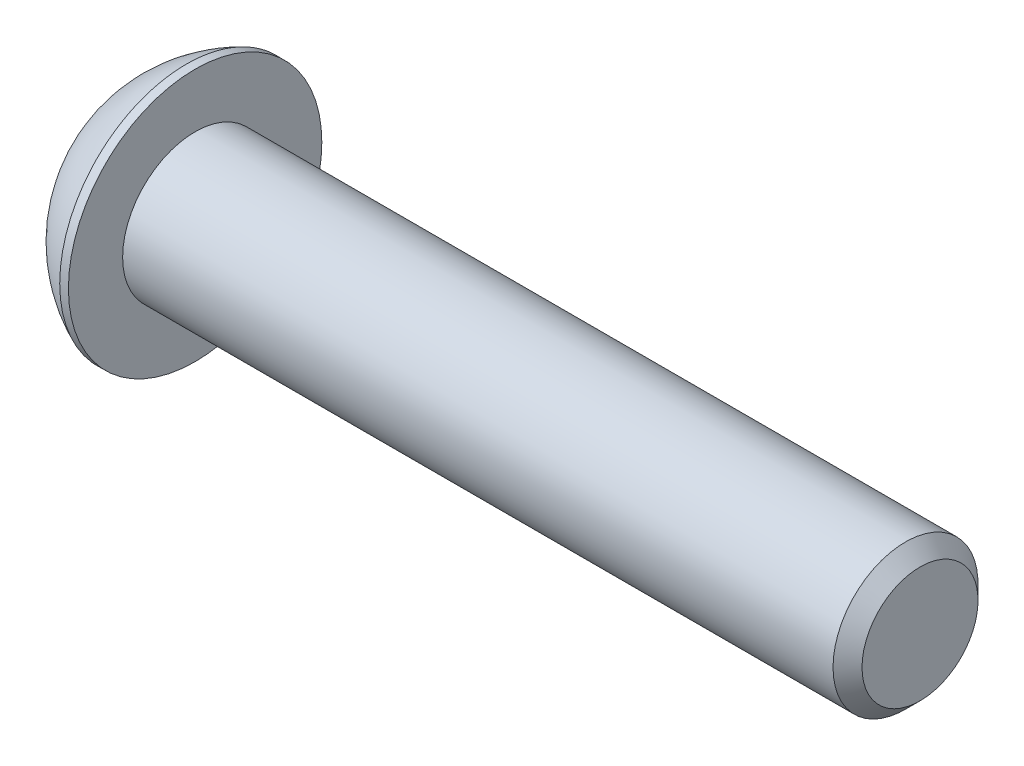
ISO-10303-21;
HEADER;
FILE_DESCRIPTION(('STEP AP214'),'2;1');
FILE_NAME('part.step','',(''),(''),'','','');
FILE_SCHEMA(('AUTOMOTIVE_DESIGN { 1 0 10303 214 1 1 1 1 }'));
ENDSEC;
DATA;
#1=APPLICATION_CONTEXT('core data for automotive mechanical design processes');
#2=APPLICATION_PROTOCOL_DEFINITION('international standard','automotive_design',2000,#1);
#3=PRODUCT_CONTEXT('',#1,'mechanical');
#4=PRODUCT('Part','Part','',(#3));
#5=PRODUCT_RELATED_PRODUCT_CATEGORY('part','',(#4));
#6=PRODUCT_DEFINITION_FORMATION('','',#4);
#7=PRODUCT_DEFINITION_CONTEXT('part definition',#1,'design');
#8=PRODUCT_DEFINITION('design','',#6,#7);
#9=PRODUCT_DEFINITION_SHAPE('','',#8);
#10=(LENGTH_UNIT() NAMED_UNIT(*) SI_UNIT(.MILLI.,.METRE.));
#11=(NAMED_UNIT(*) PLANE_ANGLE_UNIT() SI_UNIT($,.RADIAN.));
#12=(NAMED_UNIT(*) SI_UNIT($,.STERADIAN.) SOLID_ANGLE_UNIT());
#13=UNCERTAINTY_MEASURE_WITH_UNIT(LENGTH_MEASURE(1.E-05),#10,'distance_accuracy_value','');
#14=(GEOMETRIC_REPRESENTATION_CONTEXT(3) GLOBAL_UNCERTAINTY_ASSIGNED_CONTEXT((#13)) GLOBAL_UNIT_ASSIGNED_CONTEXT((#10,
#11,#12)) REPRESENTATION_CONTEXT('',''));
#15=CARTESIAN_POINT('',(0.,0.,0.));
#16=DIRECTION('',(0.,0.,1.));
#17=DIRECTION('',(1.,0.,0.));
#18=AXIS2_PLACEMENT_3D('',#15,#16,#17);
#19=CARTESIAN_POINT('',(1.32080000000034,0.,0.));
#20=DIRECTION('',(-1.,0.,0.));
#21=DIRECTION('',(0.,0.,1.));
#22=AXIS2_PLACEMENT_3D('',#19,#20,#21);
#23=CONICAL_SURFACE('',#22,1.1937999999998,1.04719755119608);
#24=CARTESIAN_POINT('',(2.01004075135902,0.,-4.44089209850063E-13));
#25=VERTEX_POINT('',#24);
#26=VERTEX_LOOP('',#25);
#27=FACE_BOUND('',#26,.T.);
#28=CARTESIAN_POINT('',(1.32080000000009,0.,0.));
#29=DIRECTION('',(-1.,0.,0.));
#30=DIRECTION('',(0.,0.,1.));
#31=AXIS2_PLACEMENT_3D('',#28,#29,#30);
#32=CIRCLE('',#31,1.19380000000024);
#33=CARTESIAN_POINT('',(1.32080000000009,0.,1.19380000000024));
#34=VERTEX_POINT('',#33);
#35=EDGE_CURVE('E20',#34,#34,#32,.T.);
#36=ORIENTED_EDGE('',*,*,#35,.T.);
#37=EDGE_LOOP('',(#36));
#38=FACE_BOUND('',#37,.T.);
#39=ADVANCED_FACE('F17',(#27,#38),#23,.F.);
#40=CARTESIAN_POINT('',(1.3208,-2.29135888084633,0.));
#41=DIRECTION('',(1.,0.,0.));
#42=DIRECTION('',(0.,0.,-1.));
#43=AXIS2_PLACEMENT_3D('',#40,#41,#42);
#44=PLANE('',#43);
#45=DIRECTION('',(0.,1.,0.));
#46=VECTOR('',#45,1.);
#47=CARTESIAN_POINT('',(1.3208,-1.14567944042316,1.984375));
#48=LINE('',#47,#46);
#49=CARTESIAN_POINT('',(1.3208,1.14567944042316,1.984375));
#50=VERTEX_POINT('',#49);
#51=CARTESIAN_POINT('',(1.3208,-1.14567944042316,1.984375));
#52=VERTEX_POINT('',#51);
#53=EDGE_CURVE('E69',#50,#52,#48,.F.);
#54=ORIENTED_EDGE('',*,*,#53,.F.);
#55=DIRECTION('',(0.,0.5,-0.866025403784439));
#56=VECTOR('',#55,1.);
#57=CARTESIAN_POINT('',(1.3208,1.14567944042316,1.984375));
#58=LINE('',#57,#56);
#59=CARTESIAN_POINT('',(1.3208,2.29135888084633,0.));
#60=VERTEX_POINT('',#59);
#61=EDGE_CURVE('E287',#60,#50,#58,.F.);
#62=ORIENTED_EDGE('',*,*,#61,.F.);
#63=DIRECTION('',(0.,-0.5,-0.866025403784439));
#64=VECTOR('',#63,1.);
#65=CARTESIAN_POINT('',(1.3208,2.29135888084633,0.));
#66=LINE('',#65,#64);
#67=CARTESIAN_POINT('',(1.3208,1.14567944042316,-1.984375));
#68=VERTEX_POINT('',#67);
#69=EDGE_CURVE('E291',#68,#60,#66,.F.);
#70=ORIENTED_EDGE('',*,*,#69,.F.);
#71=DIRECTION('',(0.,1.,0.));
#72=VECTOR('',#71,1.);
#73=CARTESIAN_POINT('',(1.3208,1.14567944042316,-1.984375));
#74=LINE('',#73,#72);
#75=CARTESIAN_POINT('',(1.3208,-1.14567944042316,-1.984375));
#76=VERTEX_POINT('',#75);
#77=EDGE_CURVE('E296',#76,#68,#74,.T.);
#78=ORIENTED_EDGE('',*,*,#77,.F.);
#79=DIRECTION('',(0.,-0.500000000000001,0.866025403784438));
#80=VECTOR('',#79,1.);
#81=CARTESIAN_POINT('',(1.3208,-1.14567944042316,-1.984375));
#82=LINE('',#81,#80);
#83=CARTESIAN_POINT('',(1.3208,-2.29135888084633,0.));
#84=VERTEX_POINT('',#83);
#85=EDGE_CURVE('E301',#84,#76,#82,.F.);
#86=ORIENTED_EDGE('',*,*,#85,.F.);
#87=DIRECTION('',(0.,0.500000000000001,0.866025403784438));
#88=VECTOR('',#87,1.);
#89=CARTESIAN_POINT('',(1.3208,-2.29135888084633,0.));
#90=LINE('',#89,#88);
#91=EDGE_CURVE('E82',#52,#84,#90,.F.);
#92=ORIENTED_EDGE('',*,*,#91,.F.);
#93=EDGE_LOOP('',(#54,#62,#70,#78,#86,#92));
#94=FACE_BOUND('',#93,.T.);
#95=ORIENTED_EDGE('',*,*,#35,.F.);
#96=EDGE_LOOP('',(#95));
#97=FACE_BOUND('',#96,.T.);
#98=ADVANCED_FACE('F75',(#94,#97),#44,.F.);
#99=CARTESIAN_POINT('',(1.3208,-1.14567944042316,1.984375));
#100=DIRECTION('',(0.,0.,-1.));
#101=DIRECTION('',(0.,1.,0.));
#102=AXIS2_PLACEMENT_3D('',#99,#100,#101);
#103=PLANE('',#102);
#104=ORIENTED_EDGE('',*,*,#53,.T.);
#105=DIRECTION('',(1.,0.,0.));
#106=VECTOR('',#105,1.);
#107=CARTESIAN_POINT('',(1.3208,-1.14567944042316,1.984375));
#108=LINE('',#107,#106);
#109=CARTESIAN_POINT('',(0.,-1.14567944042316,1.984375));
#110=VERTEX_POINT('',#109);
#111=EDGE_CURVE('E79',#110,#52,#108,.T.);
#112=ORIENTED_EDGE('',*,*,#111,.F.);
#113=DIRECTION('',(0.,1.,0.));
#114=VECTOR('',#113,1.);
#115=CARTESIAN_POINT('',(0.,0.,1.984375));
#116=LINE('',#115,#114);
#117=CARTESIAN_POINT('',(0.,1.14567944042316,1.984375));
#118=VERTEX_POINT('',#117);
#119=EDGE_CURVE('E281',#118,#110,#116,.F.);
#120=ORIENTED_EDGE('',*,*,#119,.F.);
#121=DIRECTION('',(1.,0.,0.));
#122=VECTOR('',#121,1.);
#123=CARTESIAN_POINT('',(1.3208,1.14567944042316,1.984375));
#124=LINE('',#123,#122);
#125=EDGE_CURVE('E284',#50,#118,#124,.F.);
#126=ORIENTED_EDGE('',*,*,#125,.F.);
#127=EDGE_LOOP('',(#104,#112,#120,#126));
#128=FACE_BOUND('',#127,.T.);
#129=ADVANCED_FACE('F128',(#128),#103,.T.);
#130=CARTESIAN_POINT('',(1.3208,-2.29135888084633,0.));
#131=DIRECTION('',(0.,0.866025403784438,-0.500000000000001));
#132=DIRECTION('',(0.,0.500000000000001,0.866025403784438));
#133=AXIS2_PLACEMENT_3D('',#130,#131,#132);
#134=PLANE('',#133);
#135=ORIENTED_EDGE('',*,*,#91,.T.);
#136=DIRECTION('',(1.,0.,0.));
#137=VECTOR('',#136,1.);
#138=CARTESIAN_POINT('',(1.3208,-2.29135888084633,0.));
#139=LINE('',#138,#137);
#140=CARTESIAN_POINT('',(0.,-2.29135888084633,0.));
#141=VERTEX_POINT('',#140);
#142=EDGE_CURVE('E303',#141,#84,#139,.T.);
#143=ORIENTED_EDGE('',*,*,#142,.F.);
#144=DIRECTION('',(0.,-0.500000000000001,-0.866025403784438));
#145=VECTOR('',#144,1.);
#146=CARTESIAN_POINT('',(0.,-1.14567944042316,1.984375));
#147=LINE('',#146,#145);
#148=EDGE_CURVE('E278',#110,#141,#147,.T.);
#149=ORIENTED_EDGE('',*,*,#148,.F.);
#150=ORIENTED_EDGE('',*,*,#111,.T.);
#151=EDGE_LOOP('',(#135,#143,#149,#150));
#152=FACE_BOUND('',#151,.T.);
#153=ADVANCED_FACE('F124',(#152),#134,.T.);
#154=CARTESIAN_POINT('',(1.3208,-1.14567944042316,-1.984375));
#155=DIRECTION('',(0.,0.866025403784438,0.500000000000001));
#156=DIRECTION('',(0.,-0.500000000000001,0.866025403784438));
#157=AXIS2_PLACEMENT_3D('',#154,#155,#156);
#158=PLANE('',#157);
#159=ORIENTED_EDGE('',*,*,#85,.T.);
#160=DIRECTION('',(1.,0.,0.));
#161=VECTOR('',#160,1.);
#162=CARTESIAN_POINT('',(1.3208,-1.14567944042316,-1.984375));
#163=LINE('',#162,#161);
#164=CARTESIAN_POINT('',(0.,-1.14567944042316,-1.984375));
#165=VERTEX_POINT('',#164);
#166=EDGE_CURVE('E298',#165,#76,#163,.T.);
#167=ORIENTED_EDGE('',*,*,#166,.F.);
#168=DIRECTION('',(0.,0.500000000000001,-0.866025403784438));
#169=VECTOR('',#168,1.);
#170=CARTESIAN_POINT('',(0.,-2.29135888084633,0.));
#171=LINE('',#170,#169);
#172=EDGE_CURVE('E275',#141,#165,#171,.T.);
#173=ORIENTED_EDGE('',*,*,#172,.F.);
#174=ORIENTED_EDGE('',*,*,#142,.T.);
#175=EDGE_LOOP('',(#159,#167,#173,#174));
#176=FACE_BOUND('',#175,.T.);
#177=ADVANCED_FACE('F120',(#176),#158,.T.);
#178=CARTESIAN_POINT('',(1.3208,1.14567944042316,-1.984375));
#179=DIRECTION('',(0.,0.,1.));
#180=DIRECTION('',(1.,0.,0.));
#181=AXIS2_PLACEMENT_3D('',#178,#179,#180);
#182=PLANE('',#181);
#183=ORIENTED_EDGE('',*,*,#77,.T.);
#184=DIRECTION('',(1.,0.,0.));
#185=VECTOR('',#184,1.);
#186=CARTESIAN_POINT('',(1.3208,1.14567944042316,-1.984375));
#187=LINE('',#186,#185);
#188=CARTESIAN_POINT('',(0.,1.14567944042316,-1.984375));
#189=VERTEX_POINT('',#188);
#190=EDGE_CURVE('E293',#189,#68,#187,.T.);
#191=ORIENTED_EDGE('',*,*,#190,.F.);
#192=DIRECTION('',(0.,1.,0.));
#193=VECTOR('',#192,1.);
#194=CARTESIAN_POINT('',(0.,0.,-1.984375));
#195=LINE('',#194,#193);
#196=EDGE_CURVE('E272',#165,#189,#195,.T.);
#197=ORIENTED_EDGE('',*,*,#196,.F.);
#198=ORIENTED_EDGE('',*,*,#166,.T.);
#199=EDGE_LOOP('',(#183,#191,#197,#198));
#200=FACE_BOUND('',#199,.T.);
#201=ADVANCED_FACE('F117',(#200),#182,.T.);
#202=CARTESIAN_POINT('',(1.3208,2.29135888084633,0.));
#203=DIRECTION('',(0.,-0.866025403784439,0.5));
#204=DIRECTION('',(0.,-0.5,-0.866025403784439));
#205=AXIS2_PLACEMENT_3D('',#202,#203,#204);
#206=PLANE('',#205);
#207=ORIENTED_EDGE('',*,*,#69,.T.);
#208=DIRECTION('',(1.,0.,0.));
#209=VECTOR('',#208,1.);
#210=CARTESIAN_POINT('',(1.3208,2.29135888084633,0.));
#211=LINE('',#210,#209);
#212=CARTESIAN_POINT('',(0.,2.29135888084633,0.));
#213=VERTEX_POINT('',#212);
#214=EDGE_CURVE('E35',#213,#60,#211,.T.);
#215=ORIENTED_EDGE('',*,*,#214,.F.);
#216=DIRECTION('',(0.,0.5,0.866025403784439));
#217=VECTOR('',#216,1.);
#218=CARTESIAN_POINT('',(0.,1.14567944042316,-1.984375));
#219=LINE('',#218,#217);
#220=EDGE_CURVE('E269',#189,#213,#219,.T.);
#221=ORIENTED_EDGE('',*,*,#220,.F.);
#222=ORIENTED_EDGE('',*,*,#190,.T.);
#223=EDGE_LOOP('',(#207,#215,#221,#222));
#224=FACE_BOUND('',#223,.T.);
#225=ADVANCED_FACE('F113',(#224),#206,.T.);
#226=CARTESIAN_POINT('',(1.3208,1.14567944042316,1.984375));
#227=DIRECTION('',(0.,-0.866025403784439,-0.5));
#228=DIRECTION('',(0.,0.5,-0.866025403784439));
#229=AXIS2_PLACEMENT_3D('',#226,#227,#228);
#230=PLANE('',#229);
#231=ORIENTED_EDGE('',*,*,#61,.T.);
#232=ORIENTED_EDGE('',*,*,#125,.T.);
#233=DIRECTION('',(0.,-0.5,0.866025403784438));
#234=VECTOR('',#233,1.);
#235=CARTESIAN_POINT('',(0.,2.29135888084633,0.));
#236=LINE('',#235,#234);
#237=EDGE_CURVE('E100',#213,#118,#236,.T.);
#238=ORIENTED_EDGE('',*,*,#237,.F.);
#239=ORIENTED_EDGE('',*,*,#214,.T.);
#240=EDGE_LOOP('',(#231,#232,#238,#239));
#241=FACE_BOUND('',#240,.T.);
#242=ADVANCED_FACE('F109',(#241),#230,.T.);
#243=CARTESIAN_POINT('',(0.,0.,0.));
#244=DIRECTION('',(-1.,0.,0.));
#245=DIRECTION('',(0.,0.,1.));
#246=AXIS2_PLACEMENT_3D('',#243,#244,#245);
#247=PLANE('',#246);
#248=ORIENTED_EDGE('',*,*,#220,.T.);
#249=ORIENTED_EDGE('',*,*,#237,.T.);
#250=ORIENTED_EDGE('',*,*,#119,.T.);
#251=ORIENTED_EDGE('',*,*,#148,.T.);
#252=ORIENTED_EDGE('',*,*,#172,.T.);
#253=ORIENTED_EDGE('',*,*,#196,.T.);
#254=EDGE_LOOP('',(#248,#249,#250,#251,#252,#253));
#255=FACE_BOUND('',#254,.T.);
#256=CARTESIAN_POINT('',(0.,2.77495,0.));
#257=CARTESIAN_POINT('',(0.,2.77494953309947,0.0779118937523459));
#258=CARTESIAN_POINT('',(0.,2.77166578388025,0.15583810591977));
#259=CARTESIAN_POINT('',(0.,2.75855213600204,0.311152012455904));
#260=CARTESIAN_POINT('',(0.,2.74872030471467,0.388539541019556));
#261=CARTESIAN_POINT('',(0.,2.72255472645676,0.542341518735717));
#262=CARTESIAN_POINT('',(-2.70414110576258E-13,2.70621065843663,0.618754223567578));
#263=CARTESIAN_POINT('',(2.71501725221868E-13,2.66713326915777,0.769973634286023));
#264=CARTESIAN_POINT('',(1.01274952524446E-12,2.64439476297869,0.844778983646282));
#265=CARTESIAN_POINT('',(1.81909959813207E-12,2.56690195943351,1.06566239301792));
#266=CARTESIAN_POINT('',(4.77081687541822E-13,2.50280672569928,1.20857954243987));
#267=CARTESIAN_POINT('',(-4.76232447128612E-13,2.35149826934097,1.48160874561538));
#268=CARTESIAN_POINT('',(0.,2.26428416790397,1.61172031233499));
#269=CARTESIAN_POINT('',(0.,2.1181093928834,1.79445660654268));
#270=CARTESIAN_POINT('',(0.,2.06678693791626,1.85333128513996));
#271=CARTESIAN_POINT('',(0.,1.95940522984449,1.96650727912792));
#272=CARTESIAN_POINT('',(0.,1.90335059143535,2.02081294920044));
#273=CARTESIAN_POINT('',(0.,1.78683891013963,2.12453280878582));
#274=CARTESIAN_POINT('',(0.,1.72637988450322,2.1739447713554));
#275=CARTESIAN_POINT('',(0.,1.60151968865711,2.26750481692908));
#276=CARTESIAN_POINT('',(0.,1.53711760864537,2.31165167810847));
#277=CARTESIAN_POINT('',(0.,1.33869902291632,2.43567242603944));
#278=CARTESIAN_POINT('',(0.,1.19934704110695,2.507235886628));
#279=CARTESIAN_POINT('',(0.,0.910681609121881,2.62590828672821));
#280=CARTESIAN_POINT('',(0.,0.761368265357398,2.67301748742278));
#281=CARTESIAN_POINT('',(0.,0.456932649466623,2.74151230664007));
#282=CARTESIAN_POINT('',(0.,0.301810346322584,2.76289778778721));
#283=CARTESIAN_POINT('',(0.,-0.00982263870895171,2.77931595661156));
#284=CARTESIAN_POINT('',(0.,-0.166333320596448,2.77434864428877));
#285=CARTESIAN_POINT('',(0.,-0.476280836814452,2.73822217653073));
#286=CARTESIAN_POINT('',(0.,-0.629717687555985,2.70706316096981));
#287=CARTESIAN_POINT('',(0.,-0.929254830044274,2.61937980771149));
#288=CARTESIAN_POINT('',(0.,-1.0753550434132,2.56285519909568));
#289=CARTESIAN_POINT('',(0.,-1.28570692598579,2.46037024128109));
#290=CARTESIAN_POINT('',(0.,-1.35439130022287,2.42323494812896));
#291=CARTESIAN_POINT('',(0.,-1.488391287199,2.34331277270256));
#292=CARTESIAN_POINT('',(0.,-1.55370767631787,2.30052720108831));
#293=CARTESIAN_POINT('',(0.,-1.68047292776594,2.20962421887055));
#294=CARTESIAN_POINT('',(0.,-1.7419235278682,2.16150923122348));
#295=CARTESIAN_POINT('',(0.,-1.86060297067992,2.06024311301283));
#296=CARTESIAN_POINT('',(0.,-1.91782768181715,2.0070871669763));
#297=CARTESIAN_POINT('',(0.,-2.08239462196651,1.8407220856554));
#298=CARTESIAN_POINT('',(0.,-2.18279764272601,1.72049499758422));
#299=CARTESIAN_POINT('',(0.,-2.36195754944063,1.46487629213018));
#300=CARTESIAN_POINT('',(0.,-2.44071525816758,1.32948525142807));
#301=CARTESIAN_POINT('',(0.,-2.54098882695274,1.11796734074395));
#302=CARTESIAN_POINT('',(0.,-2.57146177392727,1.04596540008347));
#303=CARTESIAN_POINT('',(0.,-2.62621251108999,0.899689259475764));
#304=CARTESIAN_POINT('',(0.,-2.65049531495563,0.825416953360952));
#305=CARTESIAN_POINT('',(0.,-2.69267708798766,0.675215808695207));
#306=CARTESIAN_POINT('',(0.,-2.71058613777937,0.599289789313092));
#307=CARTESIAN_POINT('',(0.,-2.73994710360127,0.446213628496932));
#308=CARTESIAN_POINT('',(0.,-2.75140092413871,0.369063855024788));
#309=CARTESIAN_POINT('',(0.,-2.76470470685522,0.24316208817343));
#310=CARTESIAN_POINT('',(0.,-2.76854547596618,0.194611672428577));
#311=CARTESIAN_POINT('',(0.,-2.77366826843264,0.0973760351839812));
#312=CARTESIAN_POINT('',(0.,-2.77495029178814,0.0486908136842395));
#313=CARTESIAN_POINT('',(0.,-2.77494953309947,-0.0779118937523475));
#314=CARTESIAN_POINT('',(0.,-2.77166578388025,-0.155838105919772));
#315=CARTESIAN_POINT('',(0.,-2.75855213600204,-0.311152012455906));
#316=CARTESIAN_POINT('',(0.,-2.74872030471467,-0.388539541019558));
#317=CARTESIAN_POINT('',(0.,-2.72255472645677,-0.542341518735719));
#318=CARTESIAN_POINT('',(-2.70149297926331E-13,-2.70621065843663,-0.61875422356758));
#319=CARTESIAN_POINT('',(2.712366972268E-13,-2.66713326915777,-0.769973634286024));
#320=CARTESIAN_POINT('',(1.0114146773846E-12,-2.64439476297869,-0.844778983646283));
#321=CARTESIAN_POINT('',(1.81656702958366E-12,-2.5669019594335,-1.06566239301792));
#322=CARTESIAN_POINT('',(4.7641829195856E-13,-2.50280672569928,-1.20857954243988));
#323=CARTESIAN_POINT('',(-4.75569026324205E-13,-2.35149826934097,-1.48160874561538));
#324=CARTESIAN_POINT('',(0.,-2.26428416790396,-1.61172031233499));
#325=CARTESIAN_POINT('',(0.,-2.1181093928834,-1.79445660654268));
#326=CARTESIAN_POINT('',(0.,-2.06678693791626,-1.85333128513997));
#327=CARTESIAN_POINT('',(0.,-1.95940522984449,-1.96650727912792));
#328=CARTESIAN_POINT('',(0.,-1.90335059143535,-2.02081294920044));
#329=CARTESIAN_POINT('',(0.,-1.78683891013963,-2.12453280878582));
#330=CARTESIAN_POINT('',(0.,-1.72637988450322,-2.1739447713554));
#331=CARTESIAN_POINT('',(0.,-1.60151968865711,-2.26750481692908));
#332=CARTESIAN_POINT('',(0.,-1.53711760864537,-2.31165167810847));
#333=CARTESIAN_POINT('',(0.,-1.33869902291632,-2.43567242603944));
#334=CARTESIAN_POINT('',(0.,-1.19934704110695,-2.507235886628));
#335=CARTESIAN_POINT('',(0.,-0.91068160912188,-2.62590828672821));
#336=CARTESIAN_POINT('',(0.,-0.761368265357396,-2.67301748742278));
#337=CARTESIAN_POINT('',(0.,-0.456932649466621,-2.74151230664007));
#338=CARTESIAN_POINT('',(0.,-0.301810346322582,-2.76289778778721));
#339=CARTESIAN_POINT('',(0.,0.00982263870895353,-2.77931595661156));
#340=CARTESIAN_POINT('',(0.,0.16633332059645,-2.77434864428876));
#341=CARTESIAN_POINT('',(0.,0.476280836814454,-2.73822217653073));
#342=CARTESIAN_POINT('',(0.,0.629717687555987,-2.70706316096981));
#343=CARTESIAN_POINT('',(0.,0.929254830044276,-2.6193798077115));
#344=CARTESIAN_POINT('',(0.,1.0753550434132,-2.56285519909568));
#345=CARTESIAN_POINT('',(0.,1.28570692598579,-2.46037024128109));
#346=CARTESIAN_POINT('',(0.,1.35439130022287,-2.42323494812896));
#347=CARTESIAN_POINT('',(0.,1.488391287199,-2.34331277270256));
#348=CARTESIAN_POINT('',(0.,1.55370767631787,-2.30052720108831));
#349=CARTESIAN_POINT('',(0.,1.68047292776594,-2.20962421887055));
#350=CARTESIAN_POINT('',(0.,1.7419235278682,-2.16150923122348));
#351=CARTESIAN_POINT('',(0.,1.86060297067992,-2.06024311301282));
#352=CARTESIAN_POINT('',(0.,1.91782768181716,-2.0070871669763));
#353=CARTESIAN_POINT('',(0.,2.08239462196651,-1.8407220856554));
#354=CARTESIAN_POINT('',(0.,2.18279764272601,-1.72049499758422));
#355=CARTESIAN_POINT('',(0.,2.36195754944063,-1.46487629213018));
#356=CARTESIAN_POINT('',(0.,2.44071525816757,-1.32948525142807));
#357=CARTESIAN_POINT('',(0.,2.54098882695273,-1.11796734074395));
#358=CARTESIAN_POINT('',(0.,2.57146177392727,-1.04596540008347));
#359=CARTESIAN_POINT('',(0.,2.62621251108999,-0.899689259475765));
#360=CARTESIAN_POINT('',(0.,2.65049531495563,-0.825416953360953));
#361=CARTESIAN_POINT('',(0.,2.69267708798766,-0.675215808695207));
#362=CARTESIAN_POINT('',(0.,2.71058613777936,-0.599289789313092));
#363=CARTESIAN_POINT('',(0.,2.73994710360127,-0.446213628496932));
#364=CARTESIAN_POINT('',(0.,2.75140092413871,-0.369063855024789));
#365=CARTESIAN_POINT('',(0.,2.76470470685522,-0.243162088173432));
#366=CARTESIAN_POINT('',(0.,2.76854547596618,-0.194611672428578));
#367=CARTESIAN_POINT('',(0.,2.77366826843264,-0.0973760351839823));
#368=CARTESIAN_POINT('',(0.,2.77495029178814,-0.0486908136842408));
#369=CARTESIAN_POINT('',(0.,2.77495,0.));
#370=B_SPLINE_CURVE_WITH_KNOTS('',3,(#256,#257,#258,#259,#260,#261,#262,#263,#264,#265,#266,
#267,#268,#269,#270,#271,#272,#273,#274,#275,#276,#277,#278,#279,#280,#281,#282,#283,#284,#285,
#286,#287,#288,#289,#290,#291,#292,#293,#294,#295,#296,#297,#298,#299,#300,#301,#302,#303,#304,
#305,#306,#307,#308,#309,#310,#311,#312,#313,#314,#315,#316,#317,#318,#319,#320,#321,#322,#323,
#324,#325,#326,#327,#328,#329,#330,#331,#332,#333,#334,#335,#336,#337,#338,#339,#340,#341,#342,
#343,#344,#345,#346,#347,#348,#349,#350,#351,#352,#353,#354,#355,#356,#357,#358,#359,#360,#361,
#362,#363,#364,#365,#366,#367,#368,#369),.UNSPECIFIED.,.T.,.F.,(4,2,2,2,2,2,2,2,2,2,2,2,2,2,2,2,
2,2,2,2,2,2,2,2,2,2,2,2,2,2,2,2,2,2,2,2,2,2,2,2,2,2,2,2,2,2,2,2,2,2,2,2,2,2,2,2,4),(0.,
0.233690856748162,0.467450716578751,0.701582538521471,0.935904756015414,1.40343220467667,
1.87097742791502,2.10505636898837,2.33890962270652,2.57286880998746,2.80688218486306,
3.27442101763127,3.74195485676357,4.20949119271389,4.67702752866417,5.14456136779641,
5.61210020056468,5.84611357544033,6.08007276272136,6.31392601643949,6.54800495751273,
7.01555018075072,7.48307762941212,7.71739984690652,7.95153166884955,8.18529152868023,
8.41898238542855,8.56502681353347,8.71107124163843,8.94476209838659,9.17852195821718,
9.4126537801599,9.64697599765384,10.1145034463151,10.5820486695534,10.8161276106268,
11.0499808643449,11.2839400516259,11.5179534265015,11.9854922592697,12.453026098402,
12.9205624343523,13.3880987703026,13.8556326094348,14.3231714422031,14.5571848170788,
14.7911440043598,15.0249972580779,15.2590761991512,15.7266214223891,16.1941488710506,
16.4284710885449,16.662602910488,16.8963627703186,17.130053627067,17.2760980551719,
17.4221424832769),.UNSPECIFIED.);
#371=CARTESIAN_POINT('',(0.,2.77495,0.));
#372=VERTEX_POINT('',#371);
#373=EDGE_CURVE('E94',#372,#372,#370,.T.);
#374=ORIENTED_EDGE('',*,*,#373,.F.);
#375=EDGE_LOOP('',(#374));
#376=FACE_BOUND('',#375,.T.);
#377=ADVANCED_FACE('F105',(#255,#376),#247,.T.);
#378=CARTESIAN_POINT('',(5.37260881410256,0.,0.));
#379=DIRECTION('',(0.,1.,0.));
#380=DIRECTION('',(1.,0.,0.));
#381=AXIS2_PLACEMENT_3D('',#378,#379,#380);
#382=SPHERICAL_SURFACE('',#381,6.04692260342999);
#383=CARTESIAN_POINT('',(2.9718,0.,0.));
#384=DIRECTION('',(-1.,0.,0.));
#385=DIRECTION('',(0.,0.,1.));
#386=AXIS2_PLACEMENT_3D('',#383,#384,#385);
#387=CIRCLE('',#386,5.5499);
#388=CARTESIAN_POINT('',(2.9718,0.,5.5499));
#389=VERTEX_POINT('',#388);
#390=EDGE_CURVE('E92',#389,#389,#387,.F.);
#391=ORIENTED_EDGE('',*,*,#390,.F.);
#392=EDGE_LOOP('',(#391));
#393=FACE_BOUND('',#392,.T.);
#394=ORIENTED_EDGE('',*,*,#373,.T.);
#395=EDGE_LOOP('',(#394));
#396=FACE_BOUND('',#395,.T.);
#397=ADVANCED_FACE('F101',(#393,#396),#382,.T.);
#398=CARTESIAN_POINT('',(35.1028,0.,0.));
#399=DIRECTION('',(-1.,0.,0.));
#400=DIRECTION('',(0.,0.,1.));
#401=AXIS2_PLACEMENT_3D('',#398,#399,#400);
#402=PLANE('',#401);
#403=CARTESIAN_POINT('',(35.1028000000042,0.,0.));
#404=DIRECTION('',(-1.,0.,0.));
#405=DIRECTION('',(0.,0.,1.));
#406=AXIS2_PLACEMENT_3D('',#403,#404,#405);
#407=CIRCLE('',#406,2.54000000001042);
#408=CARTESIAN_POINT('',(35.1028000000042,0.,2.54000000001042));
#409=VERTEX_POINT('',#408);
#410=EDGE_CURVE('E89',#409,#409,#407,.T.);
#411=ORIENTED_EDGE('',*,*,#410,.F.);
#412=EDGE_LOOP('',(#411));
#413=FACE_BOUND('',#412,.T.);
#414=ADVANCED_FACE('F154',(#413),#402,.F.);
#415=CARTESIAN_POINT('',(0.,0.,0.));
#416=DIRECTION('',(-1.,0.,0.));
#417=DIRECTION('',(0.,0.,1.));
#418=AXIS2_PLACEMENT_3D('',#415,#416,#417);
#419=CYLINDRICAL_SURFACE('',#418,5.5499);
#420=ORIENTED_EDGE('',*,*,#390,.T.);
#421=EDGE_LOOP('',(#420));
#422=FACE_BOUND('',#421,.T.);
#423=CARTESIAN_POINT('',(3.3528,0.,0.));
#424=DIRECTION('',(-1.,0.,0.));
#425=DIRECTION('',(0.,0.,1.));
#426=AXIS2_PLACEMENT_3D('',#423,#424,#425);
#427=CIRCLE('',#426,5.5499);
#428=CARTESIAN_POINT('',(3.3528,0.,5.5499));
#429=VERTEX_POINT('',#428);
#430=EDGE_CURVE('E86',#429,#429,#427,.T.);
#431=ORIENTED_EDGE('',*,*,#430,.T.);
#432=EDGE_LOOP('',(#431));
#433=FACE_BOUND('',#432,.T.);
#434=ADVANCED_FACE('F151',(#422,#433),#419,.T.);
#435=CARTESIAN_POINT('',(34.4678000000727,0.,0.));
#436=DIRECTION('',(-1.,0.,0.));
#437=DIRECTION('',(0.,0.,1.));
#438=AXIS2_PLACEMENT_3D('',#435,#436,#437);
#439=CONICAL_SURFACE('',#438,3.17499999994197,0.785398163397448);
#440=CARTESIAN_POINT('',(34.4678,0.,0.));
#441=DIRECTION('',(-1.,0.,0.));
#442=DIRECTION('',(0.,0.,1.));
#443=AXIS2_PLACEMENT_3D('',#440,#441,#442);
#444=CIRCLE('',#443,3.175);
#445=CARTESIAN_POINT('',(34.4678,0.,3.175));
#446=VERTEX_POINT('',#445);
#447=EDGE_CURVE('E26',#446,#446,#444,.T.);
#448=ORIENTED_EDGE('',*,*,#447,.F.);
#449=EDGE_LOOP('',(#448));
#450=FACE_BOUND('',#449,.T.);
#451=ORIENTED_EDGE('',*,*,#410,.T.);
#452=EDGE_LOOP('',(#451));
#453=FACE_BOUND('',#452,.T.);
#454=ADVANCED_FACE('F144',(#450,#453),#439,.T.);
#455=CARTESIAN_POINT('',(3.3528,3.175,0.));
#456=DIRECTION('',(-1.,0.,0.));
#457=DIRECTION('',(0.,0.,1.));
#458=AXIS2_PLACEMENT_3D('',#455,#456,#457);
#459=PLANE('',#458);
#460=CARTESIAN_POINT('',(3.3528,0.,0.));
#461=DIRECTION('',(-1.,0.,0.));
#462=DIRECTION('',(0.,0.,1.));
#463=AXIS2_PLACEMENT_3D('',#460,#461,#462);
#464=CIRCLE('',#463,3.175);
#465=CARTESIAN_POINT('',(3.3528,0.,3.175));
#466=VERTEX_POINT('',#465);
#467=EDGE_CURVE('E11',#466,#466,#464,.F.);
#468=ORIENTED_EDGE('',*,*,#467,.F.);
#469=EDGE_LOOP('',(#468));
#470=FACE_BOUND('',#469,.T.);
#471=ORIENTED_EDGE('',*,*,#430,.F.);
#472=EDGE_LOOP('',(#471));
#473=FACE_BOUND('',#472,.T.);
#474=ADVANCED_FACE('F138',(#470,#473),#459,.F.);
#475=CARTESIAN_POINT('',(0.,0.,0.));
#476=DIRECTION('',(-1.,0.,0.));
#477=DIRECTION('',(0.,0.,1.));
#478=AXIS2_PLACEMENT_3D('',#475,#476,#477);
#479=CYLINDRICAL_SURFACE('',#478,3.175);
#480=ORIENTED_EDGE('',*,*,#467,.T.);
#481=EDGE_LOOP('',(#480));
#482=FACE_BOUND('',#481,.T.);
#483=ORIENTED_EDGE('',*,*,#447,.T.);
#484=EDGE_LOOP('',(#483));
#485=FACE_BOUND('',#484,.T.);
#486=ADVANCED_FACE('F136',(#482,#485),#479,.T.);
#487=CLOSED_SHELL('',(#39,#98,#129,#153,#177,#201,#225,#242,#377,#397,#414,#434,#454,#474,#486));
#488=MANIFOLD_SOLID_BREP('B1',#487);
#489=ADVANCED_BREP_SHAPE_REPRESENTATION('',(#18,#488),#14);
#490=SHAPE_DEFINITION_REPRESENTATION(#9,#489);
ENDSEC;
END-ISO-10303-21;
